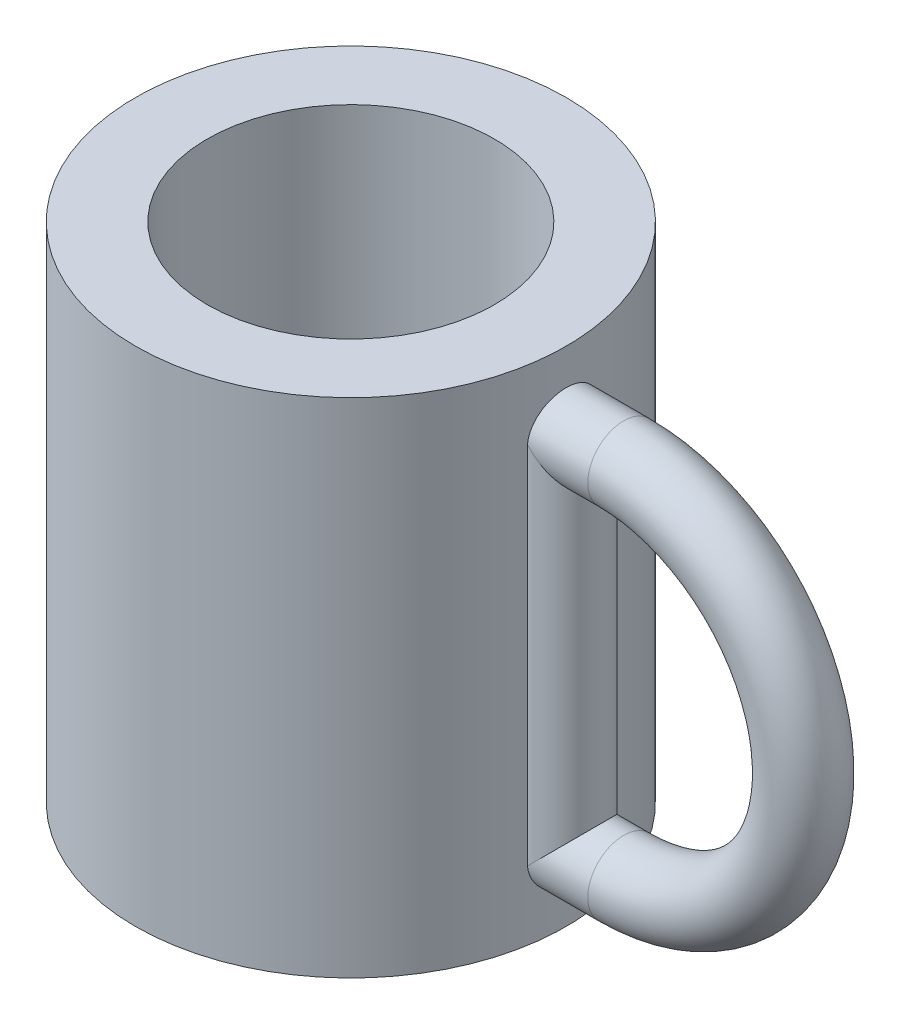
ISO-10303-21;
HEADER;
FILE_DESCRIPTION(('STEP AP214'),'2;1');
FILE_NAME('part.step','',(''),(''),'','','');
FILE_SCHEMA(('AUTOMOTIVE_DESIGN { 1 0 10303 214 1 1 1 1 }'));
ENDSEC;
DATA;
#1=APPLICATION_CONTEXT('core data for automotive mechanical design processes');
#2=APPLICATION_PROTOCOL_DEFINITION('international standard','automotive_design',2000,#1);
#3=PRODUCT_CONTEXT('',#1,'mechanical');
#4=PRODUCT('Part','Part','',(#3));
#5=PRODUCT_RELATED_PRODUCT_CATEGORY('part','',(#4));
#6=PRODUCT_DEFINITION_FORMATION('','',#4);
#7=PRODUCT_DEFINITION_CONTEXT('part definition',#1,'design');
#8=PRODUCT_DEFINITION('design','',#6,#7);
#9=PRODUCT_DEFINITION_SHAPE('','',#8);
#10=(LENGTH_UNIT() NAMED_UNIT(*) SI_UNIT(.MILLI.,.METRE.));
#11=(NAMED_UNIT(*) PLANE_ANGLE_UNIT() SI_UNIT($,.RADIAN.));
#12=(NAMED_UNIT(*) SI_UNIT($,.STERADIAN.) SOLID_ANGLE_UNIT());
#13=UNCERTAINTY_MEASURE_WITH_UNIT(LENGTH_MEASURE(1.E-05),#10,'distance_accuracy_value','');
#14=(GEOMETRIC_REPRESENTATION_CONTEXT(3) GLOBAL_UNCERTAINTY_ASSIGNED_CONTEXT((#13)) GLOBAL_UNIT_ASSIGNED_CONTEXT((#10,
#11,#12)) REPRESENTATION_CONTEXT('',''));
#15=CARTESIAN_POINT('',(0.,0.,0.));
#16=DIRECTION('',(0.,0.,1.));
#17=DIRECTION('',(1.,0.,0.));
#18=AXIS2_PLACEMENT_3D('',#15,#16,#17);
#19=CARTESIAN_POINT('',(0.,30.,0.));
#20=DIRECTION('',(0.,1.,0.));
#21=DIRECTION('',(0.,0.,1.));
#22=AXIS2_PLACEMENT_3D('',#19,#20,#21);
#23=PLANE('',#22);
#24=CARTESIAN_POINT('',(0.,30.,0.));
#25=DIRECTION('',(0.,1.,0.));
#26=DIRECTION('',(0.,0.,1.));
#27=AXIS2_PLACEMENT_3D('',#24,#25,#26);
#28=CIRCLE('',#27,15.);
#29=CARTESIAN_POINT('',(0.,30.,15.));
#30=VERTEX_POINT('',#29);
#31=EDGE_CURVE('E90',#30,#30,#28,.T.);
#32=ORIENTED_EDGE('',*,*,#31,.T.);
#33=EDGE_LOOP('',(#32));
#34=FACE_BOUND('',#33,.T.);
#35=CARTESIAN_POINT('',(0.,30.,0.));
#36=DIRECTION('',(0.,1.,0.));
#37=DIRECTION('',(0.,0.,1.));
#38=AXIS2_PLACEMENT_3D('',#35,#36,#37);
#39=CIRCLE('',#38,10.);
#40=CARTESIAN_POINT('',(0.,30.,10.));
#41=VERTEX_POINT('',#40);
#42=EDGE_CURVE('E141',#41,#41,#39,.T.);
#43=ORIENTED_EDGE('',*,*,#42,.F.);
#44=EDGE_LOOP('',(#43));
#45=FACE_BOUND('',#44,.T.);
#46=ADVANCED_FACE('F51',(#34,#45),#23,.T.);
#47=CARTESIAN_POINT('',(0.,30.,0.));
#48=DIRECTION('',(0.,-1.,0.));
#49=DIRECTION('',(0.,0.,-1.));
#50=AXIS2_PLACEMENT_3D('',#47,#48,#49);
#51=CYLINDRICAL_SURFACE('',#50,15.);
#52=DIRECTION('',(0.,1.,0.));
#53=VECTOR('',#52,1.);
#54=CARTESIAN_POINT('',(14.7916666666667,12.5,-2.49130432147946));
#55=LINE('',#54,#53);
#56=CARTESIAN_POINT('',(14.7916666666667,25.2083333333333,-2.49130432147946));
#57=VERTEX_POINT('',#56);
#58=CARTESIAN_POINT('',(14.7916666666666,-0.208333333331823,-2.49130432147958));
#59=VERTEX_POINT('',#58);
#60=EDGE_CURVE('E89',#57,#59,#55,.F.);
#61=ORIENTED_EDGE('',*,*,#60,.T.);
#62=CARTESIAN_POINT('',(15.,-2.5,0.));
#63=CARTESIAN_POINT('',(14.9999976116882,-2.49999441105218,0.139390904958215));
#64=CARTESIAN_POINT('',(14.9980367791303,-2.48830272503108,0.278857881838821));
#65=CARTESIAN_POINT('',(14.9904034494139,-2.44186434123468,0.553880221673043));
#66=CARTESIAN_POINT('',(14.9847275392389,-2.4070964430884,0.689431867959247));
#67=CARTESIAN_POINT('',(14.9703006823645,-2.31558455140725,0.952604747212644));
#68=CARTESIAN_POINT('',(14.9615522515919,-2.25885853435943,1.0802323684319));
#69=CARTESIAN_POINT('',(14.9419422708207,-2.12508770794761,1.32414184197794));
#70=CARTESIAN_POINT('',(14.9310809625443,-2.048045222517,1.44042498987859));
#71=CARTESIAN_POINT('',(14.9083331745831,-1.87504491617954,1.65947261429168));
#72=CARTESIAN_POINT('',(14.8964387181486,-1.77893088536387,1.76211290353497));
#73=CARTESIAN_POINT('',(14.8730262687673,-1.57085203152719,1.94988849865993));
#74=CARTESIAN_POINT('',(14.8615082996267,-1.45888620854339,2.03502269939097));
#75=CARTESIAN_POINT('',(14.8400756575978,-1.22142903380294,2.18586712560513));
#76=CARTESIAN_POINT('',(14.8301712909164,-1.09585866319524,2.251454552861));
#77=CARTESIAN_POINT('',(14.8131978979467,-0.835290435699375,2.36055836541122));
#78=CARTESIAN_POINT('',(14.8061286801431,-0.700293216322369,2.40407624156561));
#79=CARTESIAN_POINT('',(14.7957053684276,-0.426019725143461,2.46741437778481));
#80=CARTESIAN_POINT('',(14.792317684857,-0.286794263498609,2.4874490291354));
#81=CARTESIAN_POINT('',(14.7895393893665,-0.00691972311652917,2.50391672528988));
#82=CARTESIAN_POINT('',(14.7901484945721,0.133729254167299,2.500351440389));
#83=CARTESIAN_POINT('',(14.7952642886356,0.410927861275448,2.46989509839615));
#84=CARTESIAN_POINT('',(14.7997307331892,0.547504803545233,2.44324488188977));
#85=CARTESIAN_POINT('',(14.8119949521101,0.814221317829133,2.36775314040344));
#86=CARTESIAN_POINT('',(14.8197928407327,0.944360668888546,2.31891085431974));
#87=CARTESIAN_POINT('',(14.837884793341,1.19522882344092,2.20017724609391));
#88=CARTESIAN_POINT('',(14.8481906710733,1.31590940608123,2.13018591387971));
#89=CARTESIAN_POINT('',(14.8701291841501,1.54390440053838,1.97121201755743));
#90=CARTESIAN_POINT('',(14.8817619265429,1.65121773245493,1.88222792065429));
#91=CARTESIAN_POINT('',(14.9052202787979,1.85082608580735,1.68648221215905));
#92=CARTESIAN_POINT('',(14.9170464923165,1.94291851854008,1.57951396387313));
#93=CARTESIAN_POINT('',(14.9394260139672,2.10787776266534,1.35153524898165));
#94=CARTESIAN_POINT('',(14.9499793138975,2.18074445018323,1.23052469190642));
#95=CARTESIAN_POINT('',(14.9686389289291,2.30520222713628,0.977705916166711));
#96=CARTESIAN_POINT('',(14.9767431840745,2.35677541933126,0.845888725564661));
#97=CARTESIAN_POINT('',(14.9895750301266,2.43699421524598,0.575298345602732));
#98=CARTESIAN_POINT('',(14.9943029035047,2.46564173697372,0.436525739179468));
#99=CARTESIAN_POINT('',(14.9998112984269,2.49892135846113,0.157709901301624));
#100=CARTESIAN_POINT('',(15.0006375301278,2.50383157180561,0.0177007371510114));
#101=CARTESIAN_POINT('',(14.9983747442117,2.49023865557188,-0.261139772889887));
#102=CARTESIAN_POINT('',(14.9952858772412,2.47173642686626,-0.399971163892039));
#103=CARTESIAN_POINT('',(14.985568269382,2.41207515066452,-0.671656175546764));
#104=CARTESIAN_POINT('',(14.9789610480131,2.37105379160987,-0.804540868385379));
#105=CARTESIAN_POINT('',(14.9629446445536,2.26766548180047,-1.06154688486044));
#106=CARTESIAN_POINT('',(14.9535353051202,2.20529733236473,-1.18566771590972));
#107=CARTESIAN_POINT('',(14.9328451630241,2.06034887530321,-1.42283068946896));
#108=CARTESIAN_POINT('',(14.9215485588702,1.97759484383275,-1.53576525093715));
#109=CARTESIAN_POINT('',(14.898384673919,1.79446268461494,-1.74624358550269));
#110=CARTESIAN_POINT('',(14.8865173517155,1.69408327672333,-1.84378623969658));
#111=CARTESIAN_POINT('',(14.8634017523585,1.47730245192858,-2.021742779658));
#112=CARTESIAN_POINT('',(14.8521611613711,1.36074583448559,-2.10196876111371));
#113=CARTESIAN_POINT('',(14.8317152977788,1.11564703086146,-2.24170231029499));
#114=CARTESIAN_POINT('',(14.8225099606602,0.987105224772504,-2.30121053476982));
#115=CARTESIAN_POINT('',(14.807234536977,0.722210267187867,-2.39753833147315));
#116=CARTESIAN_POINT('',(14.8011515431106,0.585891904969511,-2.43445143254795));
#117=CARTESIAN_POINT('',(14.7927771683526,0.308879870778237,-2.48483545377828));
#118=CARTESIAN_POINT('',(14.7904854578272,0.168186580267947,-2.49830841194617));
#119=CARTESIAN_POINT('',(14.7899673308401,-0.11170516596241,-2.50137286604735));
#120=CARTESIAN_POINT('',(14.7916905650565,-0.25090037857529,-2.49126013612519));
#121=CARTESIAN_POINT('',(14.7988978145373,-0.525579248050766,-2.44807983895685));
#122=CARTESIAN_POINT('',(14.8043818176121,-0.661062916941872,-2.41501234611248));
#123=CARTESIAN_POINT('',(14.8184735628172,-0.924358437292614,-2.3269744895949));
#124=CARTESIAN_POINT('',(14.8270776721967,-1.05217901005602,-2.27202959060044));
#125=CARTESIAN_POINT('',(14.8464436892221,-1.29683566919485,-2.14182700391591));
#126=CARTESIAN_POINT('',(14.857205703884,-1.41367121037213,-2.06656830874856));
#127=CARTESIAN_POINT('',(14.8798345404562,-1.63453558310775,-1.89681888437216));
#128=CARTESIAN_POINT('',(14.891712955763,-1.73839601670027,-1.80211056359365));
#129=CARTESIAN_POINT('',(14.9151437236084,-1.92885160447494,-1.59660903138023));
#130=CARTESIAN_POINT('',(14.9266960002655,-2.01544276863817,-1.48581211291264));
#131=CARTESIAN_POINT('',(14.9482652964222,-2.16944826819995,-1.25036916964028));
#132=CARTESIAN_POINT('',(14.958271162531,-2.23672603931295,-1.12563278753282));
#133=CARTESIAN_POINT('',(14.9755116760178,-2.34926948460992,-0.866513069378981));
#134=CARTESIAN_POINT('',(14.9827490817748,-2.3945570810797,-0.73213949483001));
#135=CARTESIAN_POINT('',(14.9920579083296,-2.45200527412667,-0.4977033100454));
#136=CARTESIAN_POINT('',(14.9950202727336,-2.46997446961597,-0.399058830298447));
#137=CARTESIAN_POINT('',(14.9989921598612,-2.49397373784475,-0.200289310319808));
#138=CARTESIAN_POINT('',(15.0000017162064,-2.50000401613736,-0.100164295608494));
#139=CARTESIAN_POINT('',(15.,-2.5,0.));
#140=B_SPLINE_CURVE_WITH_KNOTS('',3,(#62,#63,#64,#65,#66,#67,#68,#69,#70,#71,#72,#73,#74,#75,
#76,#77,#78,#79,#80,#81,#82,#83,#84,#85,#86,#87,#88,#89,#90,#91,#92,#93,#94,#95,#96,#97,#98,#99,
#100,#101,#102,#103,#104,#105,#106,#107,#108,#109,#110,#111,#112,#113,#114,#115,#116,#117,#118,
#119,#120,#121,#122,#123,#124,#125,#126,#127,#128,#129,#130,#131,#132,#133,#134,#135,#136,#137,
#138,#139),.UNSPECIFIED.,.T.,.F.,(4,2,2,2,2,2,2,2,2,2,2,2,2,2,2,2,2,2,2,2,2,2,2,2,2,2,2,2,2,2,2,
2,2,2,2,2,2,2,4),(0.,0.417806584938509,0.83599754569542,1.25384686702527,1.67164841267479,
2.09302491062332,2.51442800169857,2.9384252082384,3.36239376876181,3.78246077103424,
4.20249804320886,4.61820521760409,5.03392665025381,5.45164556632557,5.86939820680573,
6.29232769911326,6.71525991635847,7.13854688915903,7.56179844521149,7.98007883491397,
8.3983431303586,8.81407807006415,9.22983635826066,9.64926825627024,10.0687306305428,
10.4925382200762,10.9163323737594,11.3383602234177,11.7603513778662,12.177079095227,
12.5938054618813,13.0100481822622,13.4263115502934,13.8475138419339,14.2688133387897,
14.693022316072,15.1168075213007,15.4170424816402,15.7172722727697),.UNSPECIFIED.);
#141=CARTESIAN_POINT('',(14.7916666666666,-0.208333333326001,2.49130432148007));
#142=VERTEX_POINT('',#141);
#143=EDGE_CURVE('E13',#59,#142,#140,.T.);
#144=ORIENTED_EDGE('',*,*,#143,.T.);
#145=DIRECTION('',(0.,1.,0.));
#146=VECTOR('',#145,1.);
#147=CARTESIAN_POINT('',(14.7916666666667,12.5,2.49130432147946));
#148=LINE('',#147,#146);
#149=CARTESIAN_POINT('',(14.7916666666667,25.2083333333333,2.49130432147946));
#150=VERTEX_POINT('',#149);
#151=EDGE_CURVE('E65',#142,#150,#148,.T.);
#152=ORIENTED_EDGE('',*,*,#151,.T.);
#153=CARTESIAN_POINT('',(14.790199457749,25.,-2.5));
#154=CARTESIAN_POINT('',(14.790201973666,24.8606242518382,-2.49999439841983));
#155=CARTESIAN_POINT('',(14.7921909238523,24.7211723939285,-2.48830516902828));
#156=CARTESIAN_POINT('',(14.7999245720004,24.4461814567368,-2.44187742806638));
#157=CARTESIAN_POINT('',(14.8056727334637,24.3106461062419,-2.40711766030861));
#158=CARTESIAN_POINT('',(14.8202560936731,24.0475077166584,-2.31562954367049));
#159=CARTESIAN_POINT('',(14.8290887118401,23.9198981513378,-2.25891955493199));
#160=CARTESIAN_POINT('',(14.8488427210228,23.6760190452822,-2.12518649688947));
#161=CARTESIAN_POINT('',(14.8597638769423,23.5597482304227,-2.04816571350133));
#162=CARTESIAN_POINT('',(14.8825847115588,23.3406871502554,-1.87518752696654));
#163=CARTESIAN_POINT('',(14.8944921732795,23.2380248686138,-1.77906904893234));
#164=CARTESIAN_POINT('',(14.9178748066858,23.0502066931382,-1.57097200469527));
#165=CARTESIAN_POINT('',(14.9293499527174,22.9650518368846,-1.45899249914997));
#166=CARTESIAN_POINT('',(14.9506573698271,22.8141854327807,-1.22152286994836));
#167=CARTESIAN_POINT('',(14.9604794243234,22.7485929922682,-1.09595608145671));
#168=CARTESIAN_POINT('',(14.9772873695709,22.6394789294695,-0.835395621723869));
#169=CARTESIAN_POINT('',(14.9842734447266,22.5959558721151,-0.700402564078189));
#170=CARTESIAN_POINT('',(14.994567347244,22.5326074650161,-0.426143726344244));
#171=CARTESIAN_POINT('',(14.9979085311091,22.5125670839953,-0.286928886679272));
#172=CARTESIAN_POINT('',(15.0006507934278,22.4960842458474,-0.00707528552579815));
#173=CARTESIAN_POINT('',(15.0000521396931,22.4996401847528,0.133563378528897));
#174=CARTESIAN_POINT('',(14.9950085843139,22.5300813515282,0.410802185078875));
#175=CARTESIAN_POINT('',(14.990601836924,22.5567351634092,0.54742853070014));
#176=CARTESIAN_POINT('',(14.9784797877164,22.6322510742465,0.81424197961179));
#177=CARTESIAN_POINT('',(14.9707643851321,22.6811138495895,0.944428886651503));
#178=CARTESIAN_POINT('',(14.9528269851196,22.7998906403153,1.19535614778265));
#179=CARTESIAN_POINT('',(14.9425936732688,22.8699000120824,1.31605052301904));
#180=CARTESIAN_POINT('',(14.920757380715,23.028912822635,1.54406552984664));
#181=CARTESIAN_POINT('',(14.9091542891913,23.1179177987108,1.65138507791587));
#182=CARTESIAN_POINT('',(14.885702682326,23.3136788066193,1.85097127344667));
#183=CARTESIAN_POINT('',(14.8738528973104,23.420637094901,1.94303950225321));
#184=CARTESIAN_POINT('',(14.8513795978481,23.6485870902158,2.10795458844806));
#185=CARTESIAN_POINT('',(14.8407560947132,23.7695789266828,2.18080126853242));
#186=CARTESIAN_POINT('',(14.8219375456182,24.0223916418775,2.30524443448829));
#187=CARTESIAN_POINT('',(14.813745233026,24.1542244980921,2.35681702727924));
#188=CARTESIAN_POINT('',(14.8007618868988,24.4248490723075,2.43702987081562));
#189=CARTESIAN_POINT('',(14.7959705538832,24.5636401764324,2.46567214076796));
#190=CARTESIAN_POINT('',(14.7903895942212,24.8424661561621,2.49893188487927));
#191=CARTESIAN_POINT('',(14.7895528575867,24.9824663797021,2.50383220791244));
#192=CARTESIAN_POINT('',(14.7918503478236,25.2612866716908,2.49022270268246));
#193=CARTESIAN_POINT('',(14.7949844213185,25.400106785514,2.47171377862467));
#194=CARTESIAN_POINT('',(14.8048268745502,25.6717277591909,2.4120523349281));
#195=CARTESIAN_POINT('',(14.8115125191835,25.804561139878,2.37104379064639));
#196=CARTESIAN_POINT('',(14.827685730055,26.0614701662795,2.26769819019228));
#197=CARTESIAN_POINT('',(14.8371734639058,26.1855452875509,2.20535985810094));
#198=CARTESIAN_POINT('',(14.8579912839739,26.4226745944061,2.06045667322923));
#199=CARTESIAN_POINT('',(14.8693375560035,26.5356165727561,1.97771056415936));
#200=CARTESIAN_POINT('',(14.8925466667987,26.746113532695,1.79458946570798));
#201=CARTESIAN_POINT('',(14.9044095418533,26.8436674311097,1.69421323638405));
#202=CARTESIAN_POINT('',(14.9274642211826,27.0216518927287,1.47742807032881));
#203=CARTESIAN_POINT('',(14.9386477634467,27.1018938262845,1.3608632533862));
#204=CARTESIAN_POINT('',(14.9589511243294,27.2416553270049,1.11574344794933));
#205=CARTESIAN_POINT('',(14.9680710096998,27.3011755644739,0.987188847470628));
#206=CARTESIAN_POINT('',(14.9831835816958,27.3975105839549,0.722299051501329));
#207=CARTESIAN_POINT('',(14.9891898456762,27.4344240757349,0.586000562602613));
#208=CARTESIAN_POINT('',(14.9974558316928,27.4848155989638,0.309030734874213));
#209=CARTESIAN_POINT('',(14.9997158620019,27.4982955587324,0.168359756821623));
#210=CARTESIAN_POINT('',(15.0002303788781,27.5013818823122,-0.111541275773674));
#211=CARTESIAN_POINT('',(14.9985330202419,27.4912752539411,-0.250768160602663));
#212=CARTESIAN_POINT('',(14.9914217838733,27.4480960777306,-0.525511974314703));
#213=CARTESIAN_POINT('',(14.9860079269518,27.4150236584903,-0.661028923967477));
#214=CARTESIAN_POINT('',(14.972069888274,27.3269618344564,-0.924396445918535));
#215=CARTESIAN_POINT('',(14.9635491704088,27.27199683179,-1.05225537215382));
#216=CARTESIAN_POINT('',(14.9443275687803,27.1417420637694,-1.29698045298217));
#217=CARTESIAN_POINT('',(14.9336265816741,27.0664513349376,-1.41384608611822));
#218=CARTESIAN_POINT('',(14.9110762961641,26.8966649075395,-1.63471294552639));
#219=CARTESIAN_POINT('',(14.8992152454112,26.8019590452488,-1.73855143060274));
#220=CARTESIAN_POINT('',(14.8757630331437,26.5964716920962,-1.92896387595091));
#221=CARTESIAN_POINT('',(14.8641719354951,26.4856864410875,-2.0155337867119));
#222=CARTESIAN_POINT('',(14.8424834353391,26.2502546775104,-2.16951427091086));
#223=CARTESIAN_POINT('',(14.8323971784578,26.1255156602345,-2.2367849890577));
#224=CARTESIAN_POINT('',(14.8149921009131,25.8663907641619,-2.34931453640427));
#225=CARTESIAN_POINT('',(14.8076705172488,25.7320146773226,-2.39459535522307));
#226=CARTESIAN_POINT('',(14.7982474485649,25.4975962305126,-2.45202605312742));
#227=CARTESIAN_POINT('',(14.7952462341947,25.3989731920374,-2.46998741767139));
#228=CARTESIAN_POINT('',(14.7912213528807,25.2002465151631,-2.49397629518131));
#229=CARTESIAN_POINT('',(14.7901976500369,25.1001429036758,-2.50000402479277));
#230=CARTESIAN_POINT('',(14.790199457749,25.,-2.5));
#231=B_SPLINE_CURVE_WITH_KNOTS('',3,(#153,#154,#155,#156,#157,#158,#159,#160,#161,#162,#163,
#164,#165,#166,#167,#168,#169,#170,#171,#172,#173,#174,#175,#176,#177,#178,#179,#180,#181,#182,
#183,#184,#185,#186,#187,#188,#189,#190,#191,#192,#193,#194,#195,#196,#197,#198,#199,#200,#201,
#202,#203,#204,#205,#206,#207,#208,#209,#210,#211,#212,#213,#214,#215,#216,#217,#218,#219,#220,
#221,#222,#223,#224,#225,#226,#227,#228,#229,#230),.UNSPECIFIED.,.T.,.F.,(4,2,2,2,2,2,2,2,2,2,2,
2,2,2,2,2,2,2,2,2,2,2,2,2,2,2,2,2,2,2,2,2,2,2,2,2,2,2,4),(0.,0.417761038927743,0.83590751996297,
1.25370499787519,1.67145547405274,2.09289159155715,2.51435267834447,2.93832980111435,
3.36227935111113,3.78231567472565,4.20232344652692,4.61817121164668,5.03403164249533,
5.45179604139425,5.86959426226764,6.29246123462123,6.71533210746019,7.13867662498604,
7.56198385938077,7.9802354242041,8.39847083413976,8.81406064635491,9.22967532293574,
9.64912342762702,10.0686010443069,10.4924411303538,10.916267504767,11.3382298441765,
11.7601574591235,12.1769777626592,12.5937957321882,13.0101503983246,13.4265248039233,
13.8476699746325,14.2689137888181,14.6931372761832,15.1169356674445,15.4171067054376,
15.7172722940182),.UNSPECIFIED.);
#232=EDGE_CURVE('E83',#150,#57,#231,.T.);
#233=ORIENTED_EDGE('',*,*,#232,.T.);
#234=EDGE_LOOP('',(#61,#144,#152,#233));
#235=FACE_BOUND('',#234,.T.);
#236=ORIENTED_EDGE('',*,*,#31,.F.);
#237=EDGE_LOOP('',(#236));
#238=FACE_BOUND('',#237,.T.);
#239=CARTESIAN_POINT('',(0.,-5.,0.));
#240=DIRECTION('',(0.,-1.,0.));
#241=DIRECTION('',(0.,0.,-1.));
#242=AXIS2_PLACEMENT_3D('',#239,#240,#241);
#243=CIRCLE('',#242,15.);
#244=CARTESIAN_POINT('',(0.,-5.,-15.));
#245=VERTEX_POINT('',#244);
#246=EDGE_CURVE('E95',#245,#245,#243,.T.);
#247=ORIENTED_EDGE('',*,*,#246,.F.);
#248=EDGE_LOOP('',(#247));
#249=FACE_BOUND('',#248,.T.);
#250=ADVANCED_FACE('F53',(#235,#238,#249),#51,.T.);
#251=CARTESIAN_POINT('',(0.,30.,0.));
#252=DIRECTION('',(0.,-1.,0.));
#253=DIRECTION('',(0.,0.,-1.));
#254=AXIS2_PLACEMENT_3D('',#251,#252,#253);
#255=CYLINDRICAL_SURFACE('',#254,10.);
#256=ORIENTED_EDGE('',*,*,#42,.T.);
#257=EDGE_LOOP('',(#256));
#258=FACE_BOUND('',#257,.T.);
#259=CARTESIAN_POINT('',(0.,0.,0.));
#260=DIRECTION('',(0.,1.,0.));
#261=DIRECTION('',(0.,0.,1.));
#262=AXIS2_PLACEMENT_3D('',#259,#260,#261);
#263=CIRCLE('',#262,10.);
#264=CARTESIAN_POINT('',(0.,0.,10.));
#265=VERTEX_POINT('',#264);
#266=EDGE_CURVE('E143',#265,#265,#263,.T.);
#267=ORIENTED_EDGE('',*,*,#266,.F.);
#268=EDGE_LOOP('',(#267));
#269=FACE_BOUND('',#268,.T.);
#270=ADVANCED_FACE('F127',(#258,#269),#255,.F.);
#271=CARTESIAN_POINT('',(0.,0.,0.));
#272=DIRECTION('',(0.,-1.,0.));
#273=DIRECTION('',(0.,0.,-1.));
#274=AXIS2_PLACEMENT_3D('',#271,#272,#273);
#275=PLANE('',#274);
#276=ORIENTED_EDGE('',*,*,#266,.T.);
#277=EDGE_LOOP('',(#276));
#278=FACE_BOUND('',#277,.T.);
#279=ADVANCED_FACE('F123',(#278),#275,.F.);
#280=CARTESIAN_POINT('',(0.,-5.,0.));
#281=DIRECTION('',(0.,-1.,0.));
#282=DIRECTION('',(0.,0.,-1.));
#283=AXIS2_PLACEMENT_3D('',#280,#281,#282);
#284=PLANE('',#283);
#285=ORIENTED_EDGE('',*,*,#246,.T.);
#286=EDGE_LOOP('',(#285));
#287=FACE_BOUND('',#286,.T.);
#288=ADVANCED_FACE('F120',(#287),#284,.T.);
#289=CARTESIAN_POINT('',(15.,-5.59999999999999,0.));
#290=DIRECTION('',(0.,1.,0.));
#291=DIRECTION('',(0.,0.,1.));
#292=AXIS2_PLACEMENT_3D('',#289,#290,#291);
#293=CYLINDRICAL_SURFACE('',#292,2.5);
#294=ORIENTED_EDGE('',*,*,#151,.F.);
#295=CARTESIAN_POINT('',(15.,0.,0.));
#296=DIRECTION('',(-0.707106781186548,0.707106781186547,0.));
#297=DIRECTION('',(-0.707106781186547,-0.707106781186547,0.));
#298=AXIS2_PLACEMENT_3D('',#295,#296,#297);
#299=ELLIPSE('',#298,3.53553390593274,2.5);
#300=EDGE_CURVE('E155',#142,#59,#299,.T.);
#301=ORIENTED_EDGE('',*,*,#300,.T.);
#302=ORIENTED_EDGE('',*,*,#60,.F.);
#303=CARTESIAN_POINT('',(15.,25.,0.));
#304=DIRECTION('',(0.707106781186548,0.707106781186547,0.));
#305=DIRECTION('',(-0.707106781186548,0.707106781186547,0.));
#306=AXIS2_PLACEMENT_3D('',#303,#304,#305);
#307=ELLIPSE('',#306,3.53553390593274,2.5);
#308=EDGE_CURVE('E71',#150,#57,#307,.T.);
#309=ORIENTED_EDGE('',*,*,#308,.F.);
#310=EDGE_LOOP('',(#294,#301,#302,#309));
#311=FACE_BOUND('',#310,.T.);
#312=ADVANCED_FACE('F93',(#311),#293,.T.);
#313=CARTESIAN_POINT('',(19.,0.,0.));
#314=DIRECTION('',(-1.,0.,0.));
#315=DIRECTION('',(0.,-1.,0.));
#316=AXIS2_PLACEMENT_3D('',#313,#314,#315);
#317=CYLINDRICAL_SURFACE('',#316,2.5);
#318=CARTESIAN_POINT('',(19.,0.,0.));
#319=DIRECTION('',(-1.,0.,0.));
#320=DIRECTION('',(0.,0.,-1.));
#321=AXIS2_PLACEMENT_3D('',#318,#319,#320);
#322=CIRCLE('',#321,2.5);
#323=CARTESIAN_POINT('',(19.,-2.5,0.));
#324=VERTEX_POINT('',#323);
#325=EDGE_CURVE('E158',#324,#324,#322,.T.);
#326=ORIENTED_EDGE('',*,*,#325,.T.);
#327=EDGE_LOOP('',(#326));
#328=FACE_BOUND('',#327,.T.);
#329=ORIENTED_EDGE('',*,*,#143,.F.);
#330=ORIENTED_EDGE('',*,*,#300,.F.);
#331=EDGE_LOOP('',(#329,#330));
#332=FACE_BOUND('',#331,.T.);
#333=ADVANCED_FACE('F112',(#328,#332),#317,.T.);
#334=CARTESIAN_POINT('',(9.4,25.,0.));
#335=DIRECTION('',(1.,0.,0.));
#336=DIRECTION('',(0.,0.,-1.));
#337=AXIS2_PLACEMENT_3D('',#334,#335,#336);
#338=CYLINDRICAL_SURFACE('',#337,2.5);
#339=CARTESIAN_POINT('',(19.,25.,0.));
#340=DIRECTION('',(1.,0.,0.));
#341=DIRECTION('',(0.,0.,-1.));
#342=AXIS2_PLACEMENT_3D('',#339,#340,#341);
#343=CIRCLE('',#342,2.5);
#344=CARTESIAN_POINT('',(19.,27.5,0.));
#345=VERTEX_POINT('',#344);
#346=EDGE_CURVE('E96',#345,#345,#343,.T.);
#347=ORIENTED_EDGE('',*,*,#346,.F.);
#348=EDGE_LOOP('',(#347));
#349=FACE_BOUND('',#348,.T.);
#350=ORIENTED_EDGE('',*,*,#232,.F.);
#351=ORIENTED_EDGE('',*,*,#308,.T.);
#352=EDGE_LOOP('',(#350,#351));
#353=FACE_BOUND('',#352,.T.);
#354=ADVANCED_FACE('F84',(#349,#353),#338,.T.);
#355=CARTESIAN_POINT('',(19.,12.5,0.));
#356=DIRECTION('',(0.,0.,-1.));
#357=DIRECTION('',(-1.,0.,0.));
#358=AXIS2_PLACEMENT_3D('',#355,#356,#357);
#359=TOROIDAL_SURFACE('',#358,12.5,2.5);
#360=CARTESIAN_POINT('',(19.,12.5,0.));
#361=DIRECTION('',(0.,0.,-1.));
#362=DIRECTION('',(-1.,0.,0.));
#363=AXIS2_PLACEMENT_3D('',#360,#361,#362);
#364=CIRCLE('',#363,15.);
#365=EDGE_CURVE('',#345,#324,#364,.T.);
#366=ORIENTED_EDGE('',*,*,#346,.T.);
#367=ORIENTED_EDGE('',*,*,#325,.F.);
#368=ORIENTED_EDGE('',*,*,#365,.T.);
#369=ORIENTED_EDGE('',*,*,#365,.F.);
#370=EDGE_LOOP('',(#366,#368,#367,#369));
#371=FACE_BOUND('',#370,.T.);
#372=ADVANCED_FACE('F111',(#371),#359,.T.);
#373=CLOSED_SHELL('',(#46,#250,#270,#279,#288,#312,#333,#354,#372));
#374=MANIFOLD_SOLID_BREP('B2',#373);
#375=ADVANCED_BREP_SHAPE_REPRESENTATION('',(#18,#374),#14);
#376=SHAPE_DEFINITION_REPRESENTATION(#9,#375);
ENDSEC;
END-ISO-10303-21;
